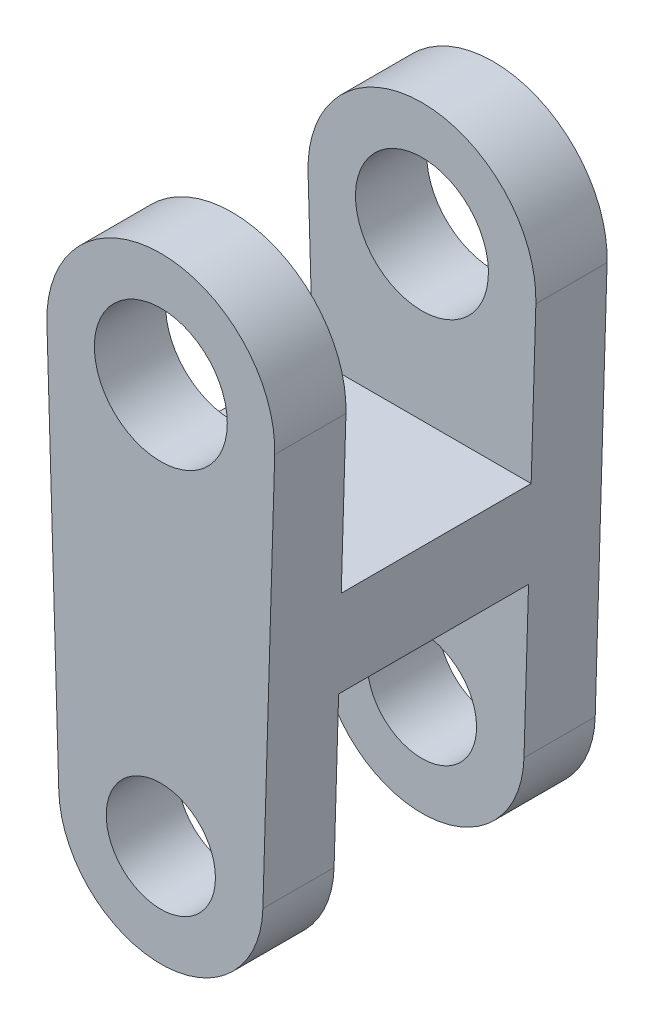
ISO-10303-21;
HEADER;
FILE_DESCRIPTION(('STEP AP214'),'2;1');
FILE_NAME('part.step','',(''),(''),'','','');
FILE_SCHEMA(('AUTOMOTIVE_DESIGN { 1 0 10303 214 1 1 1 1 }'));
ENDSEC;
DATA;
#1=APPLICATION_CONTEXT('core data for automotive mechanical design processes');
#2=APPLICATION_PROTOCOL_DEFINITION('international standard','automotive_design',2000,#1);
#3=PRODUCT_CONTEXT('',#1,'mechanical');
#4=PRODUCT('Part','Part','',(#3));
#5=PRODUCT_RELATED_PRODUCT_CATEGORY('part','',(#4));
#6=PRODUCT_DEFINITION_FORMATION('','',#4);
#7=PRODUCT_DEFINITION_CONTEXT('part definition',#1,'design');
#8=PRODUCT_DEFINITION('design','',#6,#7);
#9=PRODUCT_DEFINITION_SHAPE('','',#8);
#10=(LENGTH_UNIT() NAMED_UNIT(*) SI_UNIT(.MILLI.,.METRE.));
#11=(NAMED_UNIT(*) PLANE_ANGLE_UNIT() SI_UNIT($,.RADIAN.));
#12=(NAMED_UNIT(*) SI_UNIT($,.STERADIAN.) SOLID_ANGLE_UNIT());
#13=UNCERTAINTY_MEASURE_WITH_UNIT(LENGTH_MEASURE(1.E-05),#10,'distance_accuracy_value','');
#14=(GEOMETRIC_REPRESENTATION_CONTEXT(3) GLOBAL_UNCERTAINTY_ASSIGNED_CONTEXT((#13)) GLOBAL_UNIT_ASSIGNED_CONTEXT((#10,
#11,#12)) REPRESENTATION_CONTEXT('',''));
#15=CARTESIAN_POINT('',(0.,0.,0.));
#16=DIRECTION('',(0.,0.,1.));
#17=DIRECTION('',(1.,0.,0.));
#18=AXIS2_PLACEMENT_3D('',#15,#16,#17);
#19=CARTESIAN_POINT('',(0.,8.415,-3.5));
#20=DIRECTION('',(0.,0.,1.));
#21=DIRECTION('',(0.,-1.,0.));
#22=AXIS2_PLACEMENT_3D('',#19,#20,#21);
#23=CYLINDRICAL_SURFACE('',#22,2.39999999996615);
#24=DIRECTION('',(0.,0.,1.));
#25=VECTOR('',#24,1.);
#26=CARTESIAN_POINT('',(2.398940627,8.343698752,-2.75));
#27=LINE('',#26,#25);
#28=CARTESIAN_POINT('',(2.39894062702782,8.34369875211177,-3.5));
#29=VERTEX_POINT('',#28);
#30=CARTESIAN_POINT('',(2.39894062702782,8.34369875211177,-2.));
#31=VERTEX_POINT('',#30);
#32=EDGE_CURVE('E187',#29,#31,#27,.T.);
#33=ORIENTED_EDGE('',*,*,#32,.F.);
#34=CARTESIAN_POINT('',(0.,8.415,-3.5));
#35=DIRECTION('',(0.,0.,1.));
#36=DIRECTION('',(0.,-1.,0.));
#37=AXIS2_PLACEMENT_3D('',#34,#35,#36);
#38=CIRCLE('',#37,2.39999999996615);
#39=CARTESIAN_POINT('',(-2.39894062702782,8.34369875211177,-3.5));
#40=VERTEX_POINT('',#39);
#41=EDGE_CURVE('E217',#29,#40,#38,.T.);
#42=ORIENTED_EDGE('',*,*,#41,.T.);
#43=DIRECTION('',(0.,0.,-1.));
#44=VECTOR('',#43,1.);
#45=CARTESIAN_POINT('',(-2.398940627,8.343698752,-2.75));
#46=LINE('',#45,#44);
#47=CARTESIAN_POINT('',(-2.39894062702782,8.34369875211177,-2.));
#48=VERTEX_POINT('',#47);
#49=EDGE_CURVE('E87',#48,#40,#46,.T.);
#50=ORIENTED_EDGE('',*,*,#49,.F.);
#51=CARTESIAN_POINT('',(0.,8.415,-2.));
#52=DIRECTION('',(0.,0.,1.));
#53=DIRECTION('',(0.,-1.,0.));
#54=AXIS2_PLACEMENT_3D('',#51,#52,#53);
#55=CIRCLE('',#54,2.39999999996615);
#56=EDGE_CURVE('E20',#48,#31,#55,.F.);
#57=ORIENTED_EDGE('',*,*,#56,.T.);
#58=EDGE_LOOP('',(#33,#42,#50,#57));
#59=FACE_BOUND('',#58,.T.);
#60=ADVANCED_FACE('F17',(#59),#23,.T.);
#61=CARTESIAN_POINT('',(0.,8.415,-3.5));
#62=DIRECTION('',(0.,0.,1.));
#63=DIRECTION('',(0.,-1.,0.));
#64=AXIS2_PLACEMENT_3D('',#61,#62,#63);
#65=CYLINDRICAL_SURFACE('',#64,1.4);
#66=CARTESIAN_POINT('',(0.,8.415,-3.5));
#67=DIRECTION('',(0.,0.,1.));
#68=DIRECTION('',(0.,-1.,0.));
#69=AXIS2_PLACEMENT_3D('',#66,#67,#68);
#70=CIRCLE('',#69,1.4);
#71=CARTESIAN_POINT('',(0.,7.015,-3.5));
#72=VERTEX_POINT('',#71);
#73=EDGE_CURVE('E208',#72,#72,#70,.F.);
#74=ORIENTED_EDGE('',*,*,#73,.T.);
#75=EDGE_LOOP('',(#74));
#76=FACE_BOUND('',#75,.T.);
#77=CARTESIAN_POINT('',(0.,8.415,-2.));
#78=DIRECTION('',(0.,0.,1.));
#79=DIRECTION('',(0.,-1.,0.));
#80=AXIS2_PLACEMENT_3D('',#77,#78,#79);
#81=CIRCLE('',#80,1.4);
#82=CARTESIAN_POINT('',(0.,7.015,-2.));
#83=VERTEX_POINT('',#82);
#84=EDGE_CURVE('E218',#83,#83,#81,.T.);
#85=ORIENTED_EDGE('',*,*,#84,.T.);
#86=EDGE_LOOP('',(#85));
#87=FACE_BOUND('',#86,.T.);
#88=ADVANCED_FACE('F263',(#76,#87),#65,.F.);
#89=CARTESIAN_POINT('',(0.,0.,-3.5));
#90=DIRECTION('',(0.,0.,1.));
#91=DIRECTION('',(0.,-1.,0.));
#92=AXIS2_PLACEMENT_3D('',#89,#90,#91);
#93=CYLINDRICAL_SURFACE('',#92,2.14999999960952);
#94=DIRECTION('',(0.,0.,1.));
#95=VECTOR('',#94,1.);
#96=CARTESIAN_POINT('',(-2.149050978,-0.06387403446,-2.75));
#97=LINE('',#96,#95);
#98=CARTESIAN_POINT('',(-2.14905097819547,-0.063874034463014,-3.5));
#99=VERTEX_POINT('',#98);
#100=CARTESIAN_POINT('',(-2.14905097819547,-0.0638740344630139,-2.));
#101=VERTEX_POINT('',#100);
#102=EDGE_CURVE('E165',#99,#101,#97,.T.);
#103=ORIENTED_EDGE('',*,*,#102,.F.);
#104=CARTESIAN_POINT('',(0.,0.,-3.5));
#105=DIRECTION('',(0.,0.,1.));
#106=DIRECTION('',(0.,-1.,0.));
#107=AXIS2_PLACEMENT_3D('',#104,#105,#106);
#108=CIRCLE('',#107,2.14999999960952);
#109=CARTESIAN_POINT('',(2.14905097819547,-0.0638740344630138,-3.5));
#110=VERTEX_POINT('',#109);
#111=EDGE_CURVE('E214',#99,#110,#108,.T.);
#112=ORIENTED_EDGE('',*,*,#111,.T.);
#113=DIRECTION('',(0.,0.,-1.));
#114=VECTOR('',#113,1.);
#115=CARTESIAN_POINT('',(2.149050978,-0.0638740344599997,-2.75));
#116=LINE('',#115,#114);
#117=CARTESIAN_POINT('',(2.14905097819547,-0.0638740344630137,-2.));
#118=VERTEX_POINT('',#117);
#119=EDGE_CURVE('E185',#118,#110,#116,.T.);
#120=ORIENTED_EDGE('',*,*,#119,.F.);
#121=CARTESIAN_POINT('',(0.,0.,-2.));
#122=DIRECTION('',(0.,0.,1.));
#123=DIRECTION('',(0.,-1.,0.));
#124=AXIS2_PLACEMENT_3D('',#121,#122,#123);
#125=CIRCLE('',#124,2.14999999960952);
#126=EDGE_CURVE('E205',#118,#101,#125,.F.);
#127=ORIENTED_EDGE('',*,*,#126,.T.);
#128=EDGE_LOOP('',(#103,#112,#120,#127));
#129=FACE_BOUND('',#128,.T.);
#130=ADVANCED_FACE('F260',(#129),#93,.T.);
#131=CARTESIAN_POINT('',(0.,0.,-3.5));
#132=DIRECTION('',(0.,0.,1.));
#133=DIRECTION('',(0.,-1.,0.));
#134=AXIS2_PLACEMENT_3D('',#131,#132,#133);
#135=CYLINDRICAL_SURFACE('',#134,1.15);
#136=CARTESIAN_POINT('',(0.,0.,-3.5));
#137=DIRECTION('',(0.,0.,1.));
#138=DIRECTION('',(0.,-1.,0.));
#139=AXIS2_PLACEMENT_3D('',#136,#137,#138);
#140=CIRCLE('',#139,1.15);
#141=CARTESIAN_POINT('',(0.,-1.15,-3.5));
#142=VERTEX_POINT('',#141);
#143=EDGE_CURVE('E211',#142,#142,#140,.F.);
#144=ORIENTED_EDGE('',*,*,#143,.T.);
#145=EDGE_LOOP('',(#144));
#146=FACE_BOUND('',#145,.T.);
#147=CARTESIAN_POINT('',(0.,0.,-2.));
#148=DIRECTION('',(0.,0.,1.));
#149=DIRECTION('',(0.,-1.,0.));
#150=AXIS2_PLACEMENT_3D('',#147,#148,#149);
#151=CIRCLE('',#150,1.15);
#152=CARTESIAN_POINT('',(0.,-1.15,-2.));
#153=VERTEX_POINT('',#152);
#154=EDGE_CURVE('E171',#153,#153,#151,.T.);
#155=ORIENTED_EDGE('',*,*,#154,.T.);
#156=EDGE_LOOP('',(#155));
#157=FACE_BOUND('',#156,.T.);
#158=ADVANCED_FACE('F262',(#146,#157),#135,.F.);
#159=CARTESIAN_POINT('',(0.,5.015,0.));
#160=DIRECTION('',(0.,-1.,0.));
#161=DIRECTION('',(0.,0.,-1.));
#162=AXIS2_PLACEMENT_3D('',#159,#160,#161);
#163=PLANE('',#162);
#164=DIRECTION('',(0.,0.,1.));
#165=VECTOR('',#164,1.);
#166=CARTESIAN_POINT('',(-2.30000513368491,5.01500000000937,0.));
#167=LINE('',#166,#165);
#168=CARTESIAN_POINT('',(-2.30000513378994,5.01500000000624,-2.));
#169=VERTEX_POINT('',#168);
#170=CARTESIAN_POINT('',(-2.30000513378994,5.01500000000624,2.));
#171=VERTEX_POINT('',#170);
#172=EDGE_CURVE('E175',#169,#171,#167,.T.);
#173=ORIENTED_EDGE('',*,*,#172,.T.);
#174=DIRECTION('',(1.,0.,0.));
#175=VECTOR('',#174,1.);
#176=CARTESIAN_POINT('',(0.,5.015,2.));
#177=LINE('',#176,#175);
#178=CARTESIAN_POINT('',(2.30000513378994,5.01500000000624,2.));
#179=VERTEX_POINT('',#178);
#180=EDGE_CURVE('E105',#171,#179,#177,.T.);
#181=ORIENTED_EDGE('',*,*,#180,.T.);
#182=DIRECTION('',(0.,0.,1.));
#183=VECTOR('',#182,1.);
#184=CARTESIAN_POINT('',(2.30000513368491,5.01500000000937,0.));
#185=LINE('',#184,#183);
#186=CARTESIAN_POINT('',(2.30000513368491,5.01500000000624,-2.));
#187=VERTEX_POINT('',#186);
#188=EDGE_CURVE('E102',#179,#187,#185,.F.);
#189=ORIENTED_EDGE('',*,*,#188,.T.);
#190=DIRECTION('',(-1.,0.,0.));
#191=VECTOR('',#190,1.);
#192=CARTESIAN_POINT('',(0.,5.015,-2.));
#193=LINE('',#192,#191);
#194=EDGE_CURVE('E95',#187,#169,#193,.T.);
#195=ORIENTED_EDGE('',*,*,#194,.T.);
#196=EDGE_LOOP('',(#173,#181,#189,#195));
#197=FACE_BOUND('',#196,.T.);
#198=ADVANCED_FACE('F239',(#197),#163,.F.);
#199=CARTESIAN_POINT('',(0.,0.,-2.));
#200=DIRECTION('',(0.,0.,-1.));
#201=DIRECTION('',(-1.,0.,0.));
#202=AXIS2_PLACEMENT_3D('',#199,#200,#201);
#203=PLANE('',#202);
#204=ORIENTED_EDGE('',*,*,#84,.F.);
#205=EDGE_LOOP('',(#204));
#206=FACE_BOUND('',#205,.T.);
#207=ORIENTED_EDGE('',*,*,#56,.F.);
#208=DIRECTION('',(-0.0297088532400065,0.999558594600218,0.));
#209=VECTOR('',#208,1.);
#210=CARTESIAN_POINT('',(-2.14905097839094,-0.0638740344660279,-2.));
#211=LINE('',#210,#209);
#212=EDGE_CURVE('E177',#48,#169,#211,.F.);
#213=ORIENTED_EDGE('',*,*,#212,.T.);
#214=ORIENTED_EDGE('',*,*,#194,.F.);
#215=DIRECTION('',(0.0297088532400065,0.999558594600218,0.));
#216=VECTOR('',#215,1.);
#217=CARTESIAN_POINT('',(2.14905097839094,-0.0638740344660279,-2.));
#218=LINE('',#217,#216);
#219=EDGE_CURVE('E161',#187,#31,#218,.T.);
#220=ORIENTED_EDGE('',*,*,#219,.T.);
#221=EDGE_LOOP('',(#207,#213,#214,#220));
#222=FACE_BOUND('',#221,.T.);
#223=ADVANCED_FACE('F226',(#206,#222),#203,.F.);
#224=CARTESIAN_POINT('',(0.,0.,-3.5));
#225=DIRECTION('',(0.,0.,1.));
#226=DIRECTION('',(1.,0.,0.));
#227=AXIS2_PLACEMENT_3D('',#224,#225,#226);
#228=PLANE('',#227);
#229=ORIENTED_EDGE('',*,*,#73,.F.);
#230=EDGE_LOOP('',(#229));
#231=FACE_BOUND('',#230,.T.);
#232=ORIENTED_EDGE('',*,*,#143,.F.);
#233=EDGE_LOOP('',(#232));
#234=FACE_BOUND('',#233,.T.);
#235=DIRECTION('',(-0.0297088532400065,0.999558594600218,0.));
#236=VECTOR('',#235,1.);
#237=CARTESIAN_POINT('',(-2.14905097839094,-0.0638740344660279,-3.5));
#238=LINE('',#237,#236);
#239=EDGE_CURVE('E179',#99,#40,#238,.T.);
#240=ORIENTED_EDGE('',*,*,#239,.T.);
#241=ORIENTED_EDGE('',*,*,#41,.F.);
#242=DIRECTION('',(0.0297088532400065,0.999558594600218,0.));
#243=VECTOR('',#242,1.);
#244=CARTESIAN_POINT('',(2.14905097839094,-0.0638740344660279,-3.5));
#245=LINE('',#244,#243);
#246=EDGE_CURVE('E158',#29,#110,#245,.F.);
#247=ORIENTED_EDGE('',*,*,#246,.T.);
#248=ORIENTED_EDGE('',*,*,#111,.F.);
#249=EDGE_LOOP('',(#240,#241,#247,#248));
#250=FACE_BOUND('',#249,.T.);
#251=ADVANCED_FACE('F231',(#231,#234,#250),#228,.F.);
#252=CARTESIAN_POINT('',(0.,0.,-2.));
#253=DIRECTION('',(0.,0.,-1.));
#254=DIRECTION('',(-1.,0.,0.));
#255=AXIS2_PLACEMENT_3D('',#252,#253,#254);
#256=PLANE('',#255);
#257=ORIENTED_EDGE('',*,*,#154,.F.);
#258=EDGE_LOOP('',(#257));
#259=FACE_BOUND('',#258,.T.);
#260=ORIENTED_EDGE('',*,*,#126,.F.);
#261=DIRECTION('',(0.0297088532400065,0.999558594600218,0.));
#262=VECTOR('',#261,1.);
#263=CARTESIAN_POINT('',(2.14905097839094,-0.0638740344660279,-2.));
#264=LINE('',#263,#262);
#265=CARTESIAN_POINT('',(2.24457365463818,3.15000000000717,-2.));
#266=VERTEX_POINT('',#265);
#267=EDGE_CURVE('E130',#118,#266,#264,.T.);
#268=ORIENTED_EDGE('',*,*,#267,.T.);
#269=DIRECTION('',(1.,0.,0.));
#270=VECTOR('',#269,1.);
#271=CARTESIAN_POINT('',(0.,3.15,-2.));
#272=LINE('',#271,#270);
#273=CARTESIAN_POINT('',(-2.24457365475878,3.15000000000717,-2.));
#274=VERTEX_POINT('',#273);
#275=EDGE_CURVE('E126',#266,#274,#272,.F.);
#276=ORIENTED_EDGE('',*,*,#275,.T.);
#277=DIRECTION('',(-0.0297088532400065,0.999558594600218,0.));
#278=VECTOR('',#277,1.);
#279=CARTESIAN_POINT('',(-2.14905097839094,-0.0638740344660279,-2.));
#280=LINE('',#279,#278);
#281=EDGE_CURVE('E155',#274,#101,#280,.F.);
#282=ORIENTED_EDGE('',*,*,#281,.T.);
#283=EDGE_LOOP('',(#260,#268,#276,#282));
#284=FACE_BOUND('',#283,.T.);
#285=ADVANCED_FACE('F258',(#259,#284),#256,.F.);
#286=CARTESIAN_POINT('',(0.,0.,2.));
#287=DIRECTION('',(0.,0.,1.));
#288=DIRECTION('',(1.,0.,0.));
#289=AXIS2_PLACEMENT_3D('',#286,#287,#288);
#290=PLANE('',#289);
#291=CARTESIAN_POINT('',(0.,8.415,2.));
#292=DIRECTION('',(0.,0.,1.));
#293=DIRECTION('',(1.,0.,0.));
#294=AXIS2_PLACEMENT_3D('',#291,#292,#293);
#295=CIRCLE('',#294,1.4);
#296=CARTESIAN_POINT('',(1.4,8.415,2.));
#297=VERTEX_POINT('',#296);
#298=EDGE_CURVE('E129',#297,#297,#295,.T.);
#299=ORIENTED_EDGE('',*,*,#298,.T.);
#300=EDGE_LOOP('',(#299));
#301=FACE_BOUND('',#300,.T.);
#302=CARTESIAN_POINT('',(0.,8.415,2.));
#303=DIRECTION('',(0.,0.,1.));
#304=DIRECTION('',(1.,0.,0.));
#305=AXIS2_PLACEMENT_3D('',#302,#303,#304);
#306=CIRCLE('',#305,2.39999999996615);
#307=CARTESIAN_POINT('',(-2.39894062702782,8.34369875211177,2.));
#308=VERTEX_POINT('',#307);
#309=CARTESIAN_POINT('',(2.3989406270523,8.34369875211104,2.));
#310=VERTEX_POINT('',#309);
#311=EDGE_CURVE('E200',#308,#310,#306,.F.);
#312=ORIENTED_EDGE('',*,*,#311,.T.);
#313=DIRECTION('',(0.0297088532400065,0.999558594600218,0.));
#314=VECTOR('',#313,1.);
#315=CARTESIAN_POINT('',(2.14905097839094,-0.0638740344660279,2.));
#316=LINE('',#315,#314);
#317=EDGE_CURVE('E167',#310,#179,#316,.F.);
#318=ORIENTED_EDGE('',*,*,#317,.T.);
#319=ORIENTED_EDGE('',*,*,#180,.F.);
#320=DIRECTION('',(-0.0297088532400065,0.999558594600218,0.));
#321=VECTOR('',#320,1.);
#322=CARTESIAN_POINT('',(-2.14905097839094,-0.0638740344660279,2.));
#323=LINE('',#322,#321);
#324=EDGE_CURVE('E172',#171,#308,#323,.T.);
#325=ORIENTED_EDGE('',*,*,#324,.T.);
#326=EDGE_LOOP('',(#312,#318,#319,#325));
#327=FACE_BOUND('',#326,.T.);
#328=ADVANCED_FACE('F241',(#301,#327),#290,.F.);
#329=CARTESIAN_POINT('',(0.,3.15,0.));
#330=DIRECTION('',(0.,-1.,0.));
#331=DIRECTION('',(0.,0.,-1.));
#332=AXIS2_PLACEMENT_3D('',#329,#330,#331);
#333=PLANE('',#332);
#334=DIRECTION('',(1.,0.,0.));
#335=VECTOR('',#334,1.);
#336=CARTESIAN_POINT('',(0.,3.15,2.));
#337=LINE('',#336,#335);
#338=CARTESIAN_POINT('',(2.24457365487939,3.15000000000359,2.));
#339=VERTEX_POINT('',#338);
#340=CARTESIAN_POINT('',(-2.24457365487939,3.15000000000359,2.));
#341=VERTEX_POINT('',#340);
#342=EDGE_CURVE('E124',#339,#341,#337,.F.);
#343=ORIENTED_EDGE('',*,*,#342,.T.);
#344=DIRECTION('',(0.,0.,1.));
#345=VECTOR('',#344,1.);
#346=CARTESIAN_POINT('',(-2.24457365463818,3.15000000001075,0.));
#347=LINE('',#346,#345);
#348=EDGE_CURVE('E153',#341,#274,#347,.F.);
#349=ORIENTED_EDGE('',*,*,#348,.T.);
#350=ORIENTED_EDGE('',*,*,#275,.F.);
#351=DIRECTION('',(0.,0.,1.));
#352=VECTOR('',#351,1.);
#353=CARTESIAN_POINT('',(2.24457365463818,3.15000000001075,0.));
#354=LINE('',#353,#352);
#355=EDGE_CURVE('E119',#266,#339,#354,.T.);
#356=ORIENTED_EDGE('',*,*,#355,.T.);
#357=EDGE_LOOP('',(#343,#349,#350,#356));
#358=FACE_BOUND('',#357,.T.);
#359=ADVANCED_FACE('F121',(#358),#333,.T.);
#360=CARTESIAN_POINT('',(0.,0.,2.));
#361=DIRECTION('',(0.,0.,1.));
#362=DIRECTION('',(1.,0.,0.));
#363=AXIS2_PLACEMENT_3D('',#360,#361,#362);
#364=CYLINDRICAL_SURFACE('',#363,2.14999999960952);
#365=DIRECTION('',(0.,0.,1.));
#366=VECTOR('',#365,1.);
#367=CARTESIAN_POINT('',(2.14905097839077,-0.0638740344716146,0.));
#368=LINE('',#367,#366);
#369=CARTESIAN_POINT('',(2.14905097818799,-0.0638740347146377,2.));
#370=VERTEX_POINT('',#369);
#371=CARTESIAN_POINT('',(2.14905097819417,-0.0638740345066999,3.5));
#372=VERTEX_POINT('',#371);
#373=EDGE_CURVE('E137',#370,#372,#368,.T.);
#374=ORIENTED_EDGE('',*,*,#373,.T.);
#375=CARTESIAN_POINT('',(0.,0.,3.5));
#376=DIRECTION('',(0.,0.,1.));
#377=DIRECTION('',(1.,0.,0.));
#378=AXIS2_PLACEMENT_3D('',#375,#376,#377);
#379=CIRCLE('',#378,2.14999999960952);
#380=CARTESIAN_POINT('',(-2.14905097819417,-0.0638740345066998,3.5));
#381=VERTEX_POINT('',#380);
#382=EDGE_CURVE('E140',#372,#381,#379,.F.);
#383=ORIENTED_EDGE('',*,*,#382,.T.);
#384=DIRECTION('',(0.,0.,1.));
#385=VECTOR('',#384,1.);
#386=CARTESIAN_POINT('',(-2.14905097839077,-0.0638740344716146,0.));
#387=LINE('',#386,#385);
#388=CARTESIAN_POINT('',(-2.14905097818799,-0.0638740347146377,2.));
#389=VERTEX_POINT('',#388);
#390=EDGE_CURVE('E174',#381,#389,#387,.F.);
#391=ORIENTED_EDGE('',*,*,#390,.T.);
#392=CARTESIAN_POINT('',(0.,0.,2.));
#393=DIRECTION('',(0.,0.,1.));
#394=DIRECTION('',(1.,0.,0.));
#395=AXIS2_PLACEMENT_3D('',#392,#393,#394);
#396=CIRCLE('',#395,2.14999999960952);
#397=EDGE_CURVE('E141',#389,#370,#396,.T.);
#398=ORIENTED_EDGE('',*,*,#397,.T.);
#399=EDGE_LOOP('',(#374,#383,#391,#398));
#400=FACE_BOUND('',#399,.T.);
#401=ADVANCED_FACE('F255',(#400),#364,.T.);
#402=CARTESIAN_POINT('',(-2.14905097839094,-0.0638740344660279,0.));
#403=DIRECTION('',(0.999558594600218,0.0297088532400065,0.));
#404=DIRECTION('',(-0.0297088532400065,0.999558594600218,0.));
#405=AXIS2_PLACEMENT_3D('',#402,#403,#404);
#406=PLANE('',#405);
#407=DIRECTION('',(-0.0297088532806445,0.999558594599011,0.));
#408=VECTOR('',#407,1.);
#409=CARTESIAN_POINT('',(-2.149050978,-0.06387403446,3.5));
#410=LINE('',#409,#408);
#411=CARTESIAN_POINT('',(-2.39894062700189,8.34369875206373,3.5));
#412=VERTEX_POINT('',#411);
#413=EDGE_CURVE('E197',#381,#412,#410,.T.);
#414=ORIENTED_EDGE('',*,*,#413,.T.);
#415=DIRECTION('',(0.,0.,-1.));
#416=VECTOR('',#415,1.);
#417=CARTESIAN_POINT('',(-2.398940627,8.343698752,2.75));
#418=LINE('',#417,#416);
#419=EDGE_CURVE('E202',#412,#308,#418,.T.);
#420=ORIENTED_EDGE('',*,*,#419,.T.);
#421=ORIENTED_EDGE('',*,*,#324,.F.);
#422=ORIENTED_EDGE('',*,*,#172,.F.);
#423=ORIENTED_EDGE('',*,*,#212,.F.);
#424=ORIENTED_EDGE('',*,*,#49,.T.);
#425=ORIENTED_EDGE('',*,*,#239,.F.);
#426=ORIENTED_EDGE('',*,*,#102,.T.);
#427=ORIENTED_EDGE('',*,*,#281,.F.);
#428=ORIENTED_EDGE('',*,*,#348,.F.);
#429=DIRECTION('',(0.0297088534740751,-0.999558594593262,0.));
#430=VECTOR('',#429,1.);
#431=CARTESIAN_POINT('',(-2.244573655,3.15,2.));
#432=LINE('',#431,#430);
#433=EDGE_CURVE('E146',#341,#389,#432,.T.);
#434=ORIENTED_EDGE('',*,*,#433,.T.);
#435=ORIENTED_EDGE('',*,*,#390,.F.);
#436=EDGE_LOOP('',(#414,#420,#421,#422,#423,#424,#425,#426,#427,#428,#434,#435));
#437=FACE_BOUND('',#436,.T.);
#438=ADVANCED_FACE('F234',(#437),#406,.F.);
#439=CARTESIAN_POINT('',(0.,8.415,2.));
#440=DIRECTION('',(0.,0.,1.));
#441=DIRECTION('',(1.,0.,0.));
#442=AXIS2_PLACEMENT_3D('',#439,#440,#441);
#443=CYLINDRICAL_SURFACE('',#442,2.39999999996615);
#444=ORIENTED_EDGE('',*,*,#419,.F.);
#445=CARTESIAN_POINT('',(0.,8.415,3.5));
#446=DIRECTION('',(0.,0.,1.));
#447=DIRECTION('',(1.,0.,0.));
#448=AXIS2_PLACEMENT_3D('',#445,#446,#447);
#449=CIRCLE('',#448,2.39999999996615);
#450=CARTESIAN_POINT('',(2.39894062702637,8.343698752063,3.5));
#451=VERTEX_POINT('',#450);
#452=EDGE_CURVE('E35',#412,#451,#449,.F.);
#453=ORIENTED_EDGE('',*,*,#452,.T.);
#454=DIRECTION('',(0.,0.,1.));
#455=VECTOR('',#454,1.);
#456=CARTESIAN_POINT('',(2.39894062704896,8.34369875199855,0.));
#457=LINE('',#456,#455);
#458=EDGE_CURVE('E169',#451,#310,#457,.F.);
#459=ORIENTED_EDGE('',*,*,#458,.T.);
#460=ORIENTED_EDGE('',*,*,#311,.F.);
#461=EDGE_LOOP('',(#444,#453,#459,#460));
#462=FACE_BOUND('',#461,.T.);
#463=ADVANCED_FACE('F294',(#462),#443,.T.);
#464=CARTESIAN_POINT('',(2.14905097839094,-0.0638740344660279,0.));
#465=DIRECTION('',(0.999558594600218,-0.0297088532400065,0.));
#466=DIRECTION('',(0.0297088532400065,0.999558594600218,0.));
#467=AXIS2_PLACEMENT_3D('',#464,#465,#466);
#468=PLANE('',#467);
#469=ORIENTED_EDGE('',*,*,#355,.F.);
#470=ORIENTED_EDGE('',*,*,#267,.F.);
#471=ORIENTED_EDGE('',*,*,#119,.T.);
#472=ORIENTED_EDGE('',*,*,#246,.F.);
#473=ORIENTED_EDGE('',*,*,#32,.T.);
#474=ORIENTED_EDGE('',*,*,#219,.F.);
#475=ORIENTED_EDGE('',*,*,#188,.F.);
#476=ORIENTED_EDGE('',*,*,#317,.F.);
#477=ORIENTED_EDGE('',*,*,#458,.F.);
#478=DIRECTION('',(-0.0297088532806445,-0.999558594599011,0.));
#479=VECTOR('',#478,1.);
#480=CARTESIAN_POINT('',(2.398940627,8.343698752,3.5));
#481=LINE('',#480,#479);
#482=EDGE_CURVE('E195',#451,#372,#481,.T.);
#483=ORIENTED_EDGE('',*,*,#482,.T.);
#484=ORIENTED_EDGE('',*,*,#373,.F.);
#485=DIRECTION('',(0.0297088534740751,0.999558594593262,0.));
#486=VECTOR('',#485,1.);
#487=CARTESIAN_POINT('',(2.149050978,-0.06387403446,2.));
#488=LINE('',#487,#486);
#489=EDGE_CURVE('E134',#370,#339,#488,.T.);
#490=ORIENTED_EDGE('',*,*,#489,.T.);
#491=EDGE_LOOP('',(#469,#470,#471,#472,#473,#474,#475,#476,#477,#483,#484,#490));
#492=FACE_BOUND('',#491,.T.);
#493=ADVANCED_FACE('F135',(#492),#468,.T.);
#494=CARTESIAN_POINT('',(0.,8.415,2.));
#495=DIRECTION('',(0.,0.,1.));
#496=DIRECTION('',(1.,0.,0.));
#497=AXIS2_PLACEMENT_3D('',#494,#495,#496);
#498=CYLINDRICAL_SURFACE('',#497,1.4);
#499=CARTESIAN_POINT('',(0.,8.415,3.5));
#500=DIRECTION('',(0.,0.,1.));
#501=DIRECTION('',(1.,0.,0.));
#502=AXIS2_PLACEMENT_3D('',#499,#500,#501);
#503=CIRCLE('',#502,1.4);
#504=CARTESIAN_POINT('',(1.4,8.415,3.5));
#505=VERTEX_POINT('',#504);
#506=EDGE_CURVE('E192',#505,#505,#503,.T.);
#507=ORIENTED_EDGE('',*,*,#506,.T.);
#508=EDGE_LOOP('',(#507));
#509=FACE_BOUND('',#508,.T.);
#510=ORIENTED_EDGE('',*,*,#298,.F.);
#511=EDGE_LOOP('',(#510));
#512=FACE_BOUND('',#511,.T.);
#513=ADVANCED_FACE('F287',(#509,#512),#498,.F.);
#514=CARTESIAN_POINT('',(0.,0.,2.));
#515=DIRECTION('',(0.,0.,1.));
#516=DIRECTION('',(1.,0.,0.));
#517=AXIS2_PLACEMENT_3D('',#514,#515,#516);
#518=PLANE('',#517);
#519=CARTESIAN_POINT('',(0.,0.,2.));
#520=DIRECTION('',(0.,0.,1.));
#521=DIRECTION('',(1.,0.,0.));
#522=AXIS2_PLACEMENT_3D('',#519,#520,#521);
#523=CIRCLE('',#522,1.15);
#524=CARTESIAN_POINT('',(1.15,0.,2.));
#525=VERTEX_POINT('',#524);
#526=EDGE_CURVE('E26',#525,#525,#523,.T.);
#527=ORIENTED_EDGE('',*,*,#526,.T.);
#528=EDGE_LOOP('',(#527));
#529=FACE_BOUND('',#528,.T.);
#530=ORIENTED_EDGE('',*,*,#397,.F.);
#531=ORIENTED_EDGE('',*,*,#433,.F.);
#532=ORIENTED_EDGE('',*,*,#342,.F.);
#533=ORIENTED_EDGE('',*,*,#489,.F.);
#534=EDGE_LOOP('',(#530,#531,#532,#533));
#535=FACE_BOUND('',#534,.T.);
#536=ADVANCED_FACE('F144',(#529,#535),#518,.F.);
#537=CARTESIAN_POINT('',(0.,0.,3.5));
#538=DIRECTION('',(0.,0.,-1.));
#539=DIRECTION('',(-1.,0.,0.));
#540=AXIS2_PLACEMENT_3D('',#537,#538,#539);
#541=PLANE('',#540);
#542=ORIENTED_EDGE('',*,*,#506,.F.);
#543=EDGE_LOOP('',(#542));
#544=FACE_BOUND('',#543,.T.);
#545=CARTESIAN_POINT('',(0.,0.,3.5));
#546=DIRECTION('',(0.,0.,1.));
#547=DIRECTION('',(1.,0.,0.));
#548=AXIS2_PLACEMENT_3D('',#545,#546,#547);
#549=CIRCLE('',#548,1.15);
#550=CARTESIAN_POINT('',(1.15,0.,3.5));
#551=VERTEX_POINT('',#550);
#552=EDGE_CURVE('E11',#551,#551,#549,.F.);
#553=ORIENTED_EDGE('',*,*,#552,.T.);
#554=EDGE_LOOP('',(#553));
#555=FACE_BOUND('',#554,.T.);
#556=ORIENTED_EDGE('',*,*,#452,.F.);
#557=ORIENTED_EDGE('',*,*,#413,.F.);
#558=ORIENTED_EDGE('',*,*,#382,.F.);
#559=ORIENTED_EDGE('',*,*,#482,.F.);
#560=EDGE_LOOP('',(#556,#557,#558,#559));
#561=FACE_BOUND('',#560,.T.);
#562=ADVANCED_FACE('F247',(#544,#555,#561),#541,.F.);
#563=CARTESIAN_POINT('',(0.,0.,2.));
#564=DIRECTION('',(0.,0.,1.));
#565=DIRECTION('',(1.,0.,0.));
#566=AXIS2_PLACEMENT_3D('',#563,#564,#565);
#567=CYLINDRICAL_SURFACE('',#566,1.15);
#568=ORIENTED_EDGE('',*,*,#552,.F.);
#569=EDGE_LOOP('',(#568));
#570=FACE_BOUND('',#569,.T.);
#571=ORIENTED_EDGE('',*,*,#526,.F.);
#572=EDGE_LOOP('',(#571));
#573=FACE_BOUND('',#572,.T.);
#574=ADVANCED_FACE('F273',(#570,#573),#567,.F.);
#575=CLOSED_SHELL('',(#60,#88,#130,#158,#198,#223,#251,#285,#328,#359,#401,#438,#463,#493,#513,
#536,#562,#574));
#576=MANIFOLD_SOLID_BREP('B1',#575);
#577=ADVANCED_BREP_SHAPE_REPRESENTATION('',(#18,#576),#14);
#578=SHAPE_DEFINITION_REPRESENTATION(#9,#577);
ENDSEC;
END-ISO-10303-21;
